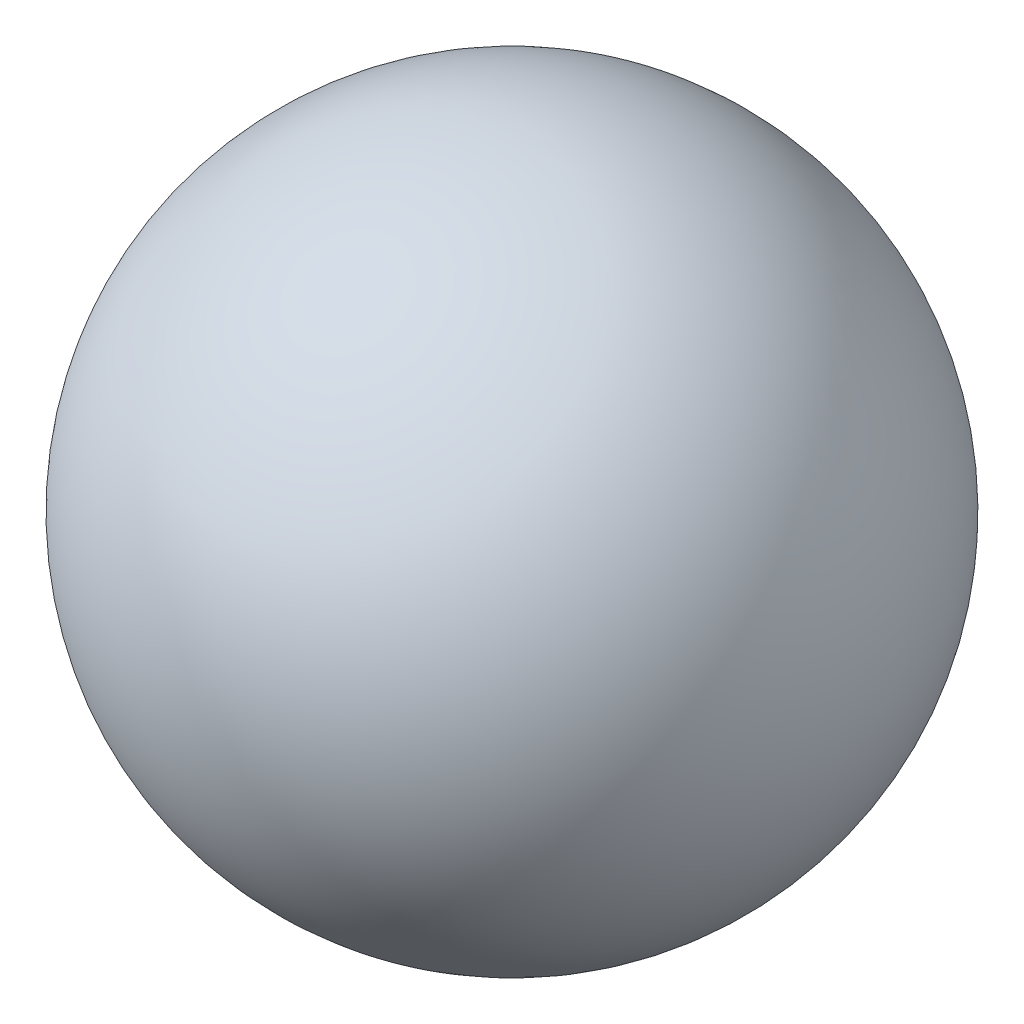
ISO-10303-21;
HEADER;
FILE_DESCRIPTION(('STEP AP214'),'2;1');
FILE_NAME('part.step','',(''),(''),'','','');
FILE_SCHEMA(('AUTOMOTIVE_DESIGN { 1 0 10303 214 1 1 1 1 }'));
ENDSEC;
DATA;
#1=APPLICATION_CONTEXT('core data for automotive mechanical design processes');
#2=APPLICATION_PROTOCOL_DEFINITION('international standard','automotive_design',2000,#1);
#3=PRODUCT_CONTEXT('',#1,'mechanical');
#4=PRODUCT('Part','Part','',(#3));
#5=PRODUCT_RELATED_PRODUCT_CATEGORY('part','',(#4));
#6=PRODUCT_DEFINITION_FORMATION('','',#4);
#7=PRODUCT_DEFINITION_CONTEXT('part definition',#1,'design');
#8=PRODUCT_DEFINITION('design','',#6,#7);
#9=PRODUCT_DEFINITION_SHAPE('','',#8);
#10=(LENGTH_UNIT() NAMED_UNIT(*) SI_UNIT(.MILLI.,.METRE.));
#11=(NAMED_UNIT(*) PLANE_ANGLE_UNIT() SI_UNIT($,.RADIAN.));
#12=(NAMED_UNIT(*) SI_UNIT($,.STERADIAN.) SOLID_ANGLE_UNIT());
#13=UNCERTAINTY_MEASURE_WITH_UNIT(LENGTH_MEASURE(1.E-05),#10,'distance_accuracy_value','');
#14=(GEOMETRIC_REPRESENTATION_CONTEXT(3) GLOBAL_UNCERTAINTY_ASSIGNED_CONTEXT((#13)) GLOBAL_UNIT_ASSIGNED_CONTEXT((#10,
#11,#12)) REPRESENTATION_CONTEXT('',''));
#15=CARTESIAN_POINT('',(0.,0.,0.));
#16=DIRECTION('',(0.,0.,1.));
#17=DIRECTION('',(1.,0.,0.));
#18=AXIS2_PLACEMENT_3D('',#15,#16,#17);
#19=CARTESIAN_POINT('',(49.75,-50.0923387005814,17.3119786204881));
#20=DIRECTION('',(0.,-0.945147382533446,0.326644187595885));
#21=DIRECTION('',(0.173648177666934,-0.321681728420802,-0.930788470058132));
#22=AXIS2_PLACEMENT_3D('',#19,#20,#21);
#23=SPHERICAL_SURFACE('',#22,5.95);
#24=CARTESIAN_POINT('',(49.75,-44.4687117745074,15.3684457042926));
#25=VERTEX_POINT('',#24);
#26=VERTEX_LOOP('',#25);
#27=FACE_BOUND('',#26,.T.);
#28=CARTESIAN_POINT('',(49.75,-55.7159656266554,19.2555115366836));
#29=VERTEX_POINT('',#28);
#30=VERTEX_LOOP('',#29);
#31=FACE_BOUND('',#30,.T.);
#32=ADVANCED_FACE('F16',(#27,#31),#23,.T.);
#33=CLOSED_SHELL('',(#32));
#34=MANIFOLD_SOLID_BREP('B1',#33);
#35=ADVANCED_BREP_SHAPE_REPRESENTATION('',(#18,#34),#14);
#36=SHAPE_DEFINITION_REPRESENTATION(#9,#35);
ENDSEC;
END-ISO-10303-21;
